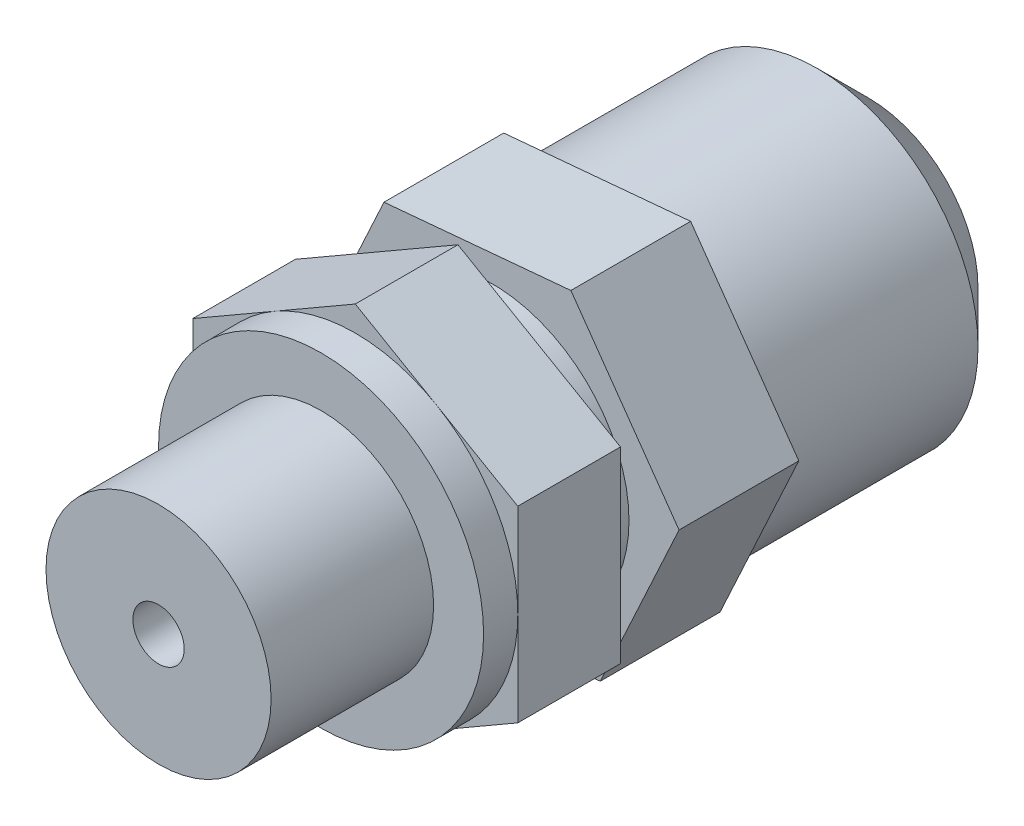
ISO-10303-21;
HEADER;
FILE_DESCRIPTION(('STEP AP214'),'2;1');
FILE_NAME('part.step','',(''),(''),'','','');
FILE_SCHEMA(('AUTOMOTIVE_DESIGN { 1 0 10303 214 1 1 1 1 }'));
ENDSEC;
DATA;
#1=APPLICATION_CONTEXT('core data for automotive mechanical design processes');
#2=APPLICATION_PROTOCOL_DEFINITION('international standard','automotive_design',2000,#1);
#3=PRODUCT_CONTEXT('',#1,'mechanical');
#4=PRODUCT('Part','Part','',(#3));
#5=PRODUCT_RELATED_PRODUCT_CATEGORY('part','',(#4));
#6=PRODUCT_DEFINITION_FORMATION('','',#4);
#7=PRODUCT_DEFINITION_CONTEXT('part definition',#1,'design');
#8=PRODUCT_DEFINITION('design','',#6,#7);
#9=PRODUCT_DEFINITION_SHAPE('','',#8);
#10=(LENGTH_UNIT() NAMED_UNIT(*) SI_UNIT(.MILLI.,.METRE.));
#11=(NAMED_UNIT(*) PLANE_ANGLE_UNIT() SI_UNIT($,.RADIAN.));
#12=(NAMED_UNIT(*) SI_UNIT($,.STERADIAN.) SOLID_ANGLE_UNIT());
#13=UNCERTAINTY_MEASURE_WITH_UNIT(LENGTH_MEASURE(1.E-05),#10,'distance_accuracy_value','');
#14=(GEOMETRIC_REPRESENTATION_CONTEXT(3) GLOBAL_UNCERTAINTY_ASSIGNED_CONTEXT((#13)) GLOBAL_UNIT_ASSIGNED_CONTEXT((#10,
#11,#12)) REPRESENTATION_CONTEXT('',''));
#15=CARTESIAN_POINT('',(0.,0.,0.));
#16=DIRECTION('',(0.,0.,1.));
#17=DIRECTION('',(1.,0.,0.));
#18=AXIS2_PLACEMENT_3D('',#15,#16,#17);
#19=CARTESIAN_POINT('',(-4.60221291555949,-9.95755841625801,-9.));
#20=DIRECTION('',(0.,0.,1.));
#21=DIRECTION('',(1.,0.,0.));
#22=AXIS2_PLACEMENT_3D('',#19,#20,#21);
#23=PLANE('',#22);
#24=DIRECTION('',(-0.576352859257245,0.817200943236117,0.));
#25=VECTOR('',#24,1.);
#26=CARTESIAN_POINT('',(-4.60221291555949,-9.95755841625801,-9.));
#27=LINE('',#26,#25);
#28=CARTESIAN_POINT('',(-4.60221291555949,-9.95755841625801,-9.));
#29=VERTEX_POINT('',#28);
#30=CARTESIAN_POINT('',(-10.9246050059267,-0.993145909629638,-9.));
#31=VERTEX_POINT('',#30);
#32=EDGE_CURVE('E162',#29,#31,#27,.T.);
#33=ORIENTED_EDGE('',*,*,#32,.T.);
#34=DIRECTION('',(0.41954034721046,0.907736689278629,0.));
#35=VECTOR('',#34,1.);
#36=CARTESIAN_POINT('',(-10.9246050059267,-0.993145909629638,-9.));
#37=LINE('',#36,#35);
#38=CARTESIAN_POINT('',(-6.32239209036723,8.96441250662837,-9.));
#39=VERTEX_POINT('',#38);
#40=EDGE_CURVE('E151',#31,#39,#37,.T.);
#41=ORIENTED_EDGE('',*,*,#40,.T.);
#42=DIRECTION('',(0.995893206467704,0.0905357460425129,0.));
#43=VECTOR('',#42,1.);
#44=CARTESIAN_POINT('',(-6.32239209036723,8.96441250662837,-9.));
#45=LINE('',#44,#43);
#46=CARTESIAN_POINT('',(4.60221291555949,9.95755841625801,-9.));
#47=VERTEX_POINT('',#46);
#48=EDGE_CURVE('E161',#39,#47,#45,.T.);
#49=ORIENTED_EDGE('',*,*,#48,.T.);
#50=DIRECTION('',(0.576352859257245,-0.817200943236117,0.));
#51=VECTOR('',#50,1.);
#52=CARTESIAN_POINT('',(4.60221291555949,9.95755841625801,-9.));
#53=LINE('',#52,#51);
#54=CARTESIAN_POINT('',(10.9246050059267,0.993145909629641,-9.));
#55=VERTEX_POINT('',#54);
#56=EDGE_CURVE('E676',#47,#55,#53,.T.);
#57=ORIENTED_EDGE('',*,*,#56,.T.);
#58=DIRECTION('',(-0.419540347210459,-0.907736689278629,0.));
#59=VECTOR('',#58,1.);
#60=CARTESIAN_POINT('',(10.9246050059267,0.993145909629641,-9.));
#61=LINE('',#60,#59);
#62=CARTESIAN_POINT('',(6.32239209036723,-8.96441250662837,-9.));
#63=VERTEX_POINT('',#62);
#64=EDGE_CURVE('E693',#55,#63,#61,.T.);
#65=ORIENTED_EDGE('',*,*,#64,.T.);
#66=DIRECTION('',(-0.995893206467704,-0.090535746042513,0.));
#67=VECTOR('',#66,1.);
#68=CARTESIAN_POINT('',(6.32239209036723,-8.96441250662837,-9.));
#69=LINE('',#68,#67);
#70=EDGE_CURVE('E167',#63,#29,#69,.T.);
#71=ORIENTED_EDGE('',*,*,#70,.T.);
#72=EDGE_LOOP('',(#33,#41,#49,#57,#65,#71));
#73=FACE_BOUND('',#72,.T.);
#74=CARTESIAN_POINT('',(0.,0.,-9.));
#75=DIRECTION('',(0.,0.,1.));
#76=DIRECTION('',(1.,0.,0.));
#77=AXIS2_PLACEMENT_3D('',#74,#75,#76);
#78=CIRCLE('',#77,9.4);
#79=CARTESIAN_POINT('',(9.4,0.,-9.));
#80=VERTEX_POINT('',#79);
#81=EDGE_CURVE('E259',#80,#80,#78,.F.);
#82=ORIENTED_EDGE('',*,*,#81,.F.);
#83=EDGE_LOOP('',(#82));
#84=FACE_BOUND('',#83,.T.);
#85=ADVANCED_FACE('F43',(#73,#84),#23,.F.);
#86=CARTESIAN_POINT('',(9.5,5.48482755730145,0.));
#87=DIRECTION('',(0.,0.,-1.));
#88=DIRECTION('',(-1.,0.,0.));
#89=AXIS2_PLACEMENT_3D('',#86,#87,#88);
#90=PLANE('',#89);
#91=DIRECTION('',(-0.866025403784439,0.5,0.));
#92=VECTOR('',#91,1.);
#93=CARTESIAN_POINT('',(9.5,5.48482755730145,0.));
#94=LINE('',#93,#92);
#95=CARTESIAN_POINT('',(9.5,5.48482755730145,0.));
#96=VERTEX_POINT('',#95);
#97=CARTESIAN_POINT('',(0.,10.9696551146029,0.));
#98=VERTEX_POINT('',#97);
#99=EDGE_CURVE('E203',#96,#98,#94,.T.);
#100=ORIENTED_EDGE('',*,*,#99,.F.);
#101=DIRECTION('',(0.,1.,0.));
#102=VECTOR('',#101,1.);
#103=CARTESIAN_POINT('',(9.5,-5.48482755730144,0.));
#104=LINE('',#103,#102);
#105=CARTESIAN_POINT('',(9.5,-5.48482755730144,0.));
#106=VERTEX_POINT('',#105);
#107=EDGE_CURVE('E240',#106,#96,#104,.T.);
#108=ORIENTED_EDGE('',*,*,#107,.F.);
#109=DIRECTION('',(0.866025403784439,0.5,0.));
#110=VECTOR('',#109,1.);
#111=CARTESIAN_POINT('',(0.,-10.9696551146029,0.));
#112=LINE('',#111,#110);
#113=CARTESIAN_POINT('',(0.,-10.9696551146029,0.));
#114=VERTEX_POINT('',#113);
#115=EDGE_CURVE('E238',#114,#106,#112,.T.);
#116=ORIENTED_EDGE('',*,*,#115,.F.);
#117=DIRECTION('',(0.866025403784439,-0.5,0.));
#118=VECTOR('',#117,1.);
#119=CARTESIAN_POINT('',(-9.5,-5.48482755730144,0.));
#120=LINE('',#119,#118);
#121=CARTESIAN_POINT('',(-9.5,-5.48482755730144,0.));
#122=VERTEX_POINT('',#121);
#123=EDGE_CURVE('E236',#122,#114,#120,.T.);
#124=ORIENTED_EDGE('',*,*,#123,.F.);
#125=DIRECTION('',(0.,-1.,0.));
#126=VECTOR('',#125,1.);
#127=CARTESIAN_POINT('',(-9.5,5.48482755730144,0.));
#128=LINE('',#127,#126);
#129=CARTESIAN_POINT('',(-9.5,5.48482755730144,0.));
#130=VERTEX_POINT('',#129);
#131=EDGE_CURVE('E234',#130,#122,#128,.T.);
#132=ORIENTED_EDGE('',*,*,#131,.F.);
#133=DIRECTION('',(-0.866025403784439,-0.5,0.));
#134=VECTOR('',#133,1.);
#135=CARTESIAN_POINT('',(0.,10.9696551146029,0.));
#136=LINE('',#135,#134);
#137=EDGE_CURVE('E232',#98,#130,#136,.T.);
#138=ORIENTED_EDGE('',*,*,#137,.F.);
#139=EDGE_LOOP('',(#100,#108,#116,#124,#132,#138));
#140=FACE_BOUND('',#139,.T.);
#141=CARTESIAN_POINT('',(0.,0.,0.));
#142=DIRECTION('',(0.,0.,-1.));
#143=DIRECTION('',(-1.,0.,0.));
#144=AXIS2_PLACEMENT_3D('',#141,#142,#143);
#145=CIRCLE('',#144,8.);
#146=CARTESIAN_POINT('',(-8.,0.,0.));
#147=VERTEX_POINT('',#146);
#148=EDGE_CURVE('E176',#147,#147,#145,.T.);
#149=ORIENTED_EDGE('',*,*,#148,.F.);
#150=EDGE_LOOP('',(#149));
#151=FACE_BOUND('',#150,.T.);
#152=ADVANCED_FACE('F275',(#140,#151),#90,.T.);
#153=CARTESIAN_POINT('',(0.,0.,8.));
#154=DIRECTION('',(0.,0.,1.));
#155=DIRECTION('',(1.,0.,0.));
#156=AXIS2_PLACEMENT_3D('',#153,#154,#155);
#157=PLANE('',#156);
#158=CARTESIAN_POINT('',(0.,0.,8.));
#159=DIRECTION('',(0.,0.,1.));
#160=DIRECTION('',(1.,0.,0.));
#161=AXIS2_PLACEMENT_3D('',#158,#159,#160);
#162=CIRCLE('',#161,9.5);
#163=CARTESIAN_POINT('',(9.5,0.,8.));
#164=VERTEX_POINT('',#163);
#165=EDGE_CURVE('E200',#164,#164,#162,.T.);
#166=ORIENTED_EDGE('',*,*,#165,.T.);
#167=EDGE_LOOP('',(#166));
#168=FACE_BOUND('',#167,.T.);
#169=CARTESIAN_POINT('',(0.,0.,8.));
#170=DIRECTION('',(0.,0.,1.));
#171=DIRECTION('',(1.,0.,0.));
#172=AXIS2_PLACEMENT_3D('',#169,#170,#171);
#173=CIRCLE('',#172,6.5785);
#174=CARTESIAN_POINT('',(6.5785,0.,8.));
#175=VERTEX_POINT('',#174);
#176=EDGE_CURVE('E191',#175,#175,#173,.T.);
#177=ORIENTED_EDGE('',*,*,#176,.F.);
#178=EDGE_LOOP('',(#177));
#179=FACE_BOUND('',#178,.T.);
#180=ADVANCED_FACE('F280',(#168,#179),#157,.T.);
#181=CARTESIAN_POINT('',(9.5,5.48482755730145,6.));
#182=DIRECTION('',(0.,0.,-1.));
#183=DIRECTION('',(-1.,0.,0.));
#184=AXIS2_PLACEMENT_3D('',#181,#182,#183);
#185=PLANE('',#184);
#186=CARTESIAN_POINT('',(0.,0.,6.));
#187=DIRECTION('',(0.,0.,1.));
#188=DIRECTION('',(1.,0.,0.));
#189=AXIS2_PLACEMENT_3D('',#186,#187,#188);
#190=CIRCLE('',#189,9.5);
#191=CARTESIAN_POINT('',(9.5,0.,6.));
#192=VERTEX_POINT('',#191);
#193=CARTESIAN_POINT('',(4.75,8.22724133595217,6.));
#194=VERTEX_POINT('',#193);
#195=EDGE_CURVE('E197',#192,#194,#190,.T.);
#196=ORIENTED_EDGE('',*,*,#195,.F.);
#197=DIRECTION('',(0.,1.,0.));
#198=VECTOR('',#197,1.);
#199=CARTESIAN_POINT('',(9.5,-5.48482755730144,6.));
#200=LINE('',#199,#198);
#201=CARTESIAN_POINT('',(9.5,5.48482755730145,6.));
#202=VERTEX_POINT('',#201);
#203=EDGE_CURVE('E226',#192,#202,#200,.T.);
#204=ORIENTED_EDGE('',*,*,#203,.T.);
#205=DIRECTION('',(-0.866025403784439,0.5,0.));
#206=VECTOR('',#205,1.);
#207=CARTESIAN_POINT('',(9.5,5.48482755730145,6.));
#208=LINE('',#207,#206);
#209=EDGE_CURVE('E207',#202,#194,#208,.T.);
#210=ORIENTED_EDGE('',*,*,#209,.T.);
#211=EDGE_LOOP('',(#196,#204,#210));
#212=FACE_BOUND('',#211,.T.);
#213=ADVANCED_FACE('F332',(#212),#185,.F.);
#214=CARTESIAN_POINT('',(-4.75,8.22724133595217,6.));
#215=VERTEX_POINT('',#214);
#216=EDGE_CURVE('E206',#194,#215,#190,.T.);
#217=ORIENTED_EDGE('',*,*,#216,.F.);
#218=CARTESIAN_POINT('',(0.,10.9696551146029,6.));
#219=VERTEX_POINT('',#218);
#220=EDGE_CURVE('E211',#194,#219,#208,.T.);
#221=ORIENTED_EDGE('',*,*,#220,.T.);
#222=DIRECTION('',(-0.866025403784439,-0.5,0.));
#223=VECTOR('',#222,1.);
#224=CARTESIAN_POINT('',(0.,10.9696551146029,6.));
#225=LINE('',#224,#223);
#226=EDGE_CURVE('E212',#219,#215,#225,.T.);
#227=ORIENTED_EDGE('',*,*,#226,.T.);
#228=EDGE_LOOP('',(#217,#221,#227));
#229=FACE_BOUND('',#228,.T.);
#230=ADVANCED_FACE('F339',(#229),#185,.F.);
#231=CARTESIAN_POINT('',(-9.5,0.,6.));
#232=VERTEX_POINT('',#231);
#233=EDGE_CURVE('E386',#215,#232,#190,.T.);
#234=ORIENTED_EDGE('',*,*,#233,.F.);
#235=CARTESIAN_POINT('',(-9.5,5.48482755730144,6.));
#236=VERTEX_POINT('',#235);
#237=EDGE_CURVE('E210',#215,#236,#225,.T.);
#238=ORIENTED_EDGE('',*,*,#237,.T.);
#239=DIRECTION('',(0.,-1.,0.));
#240=VECTOR('',#239,1.);
#241=CARTESIAN_POINT('',(-9.5,5.48482755730144,6.));
#242=LINE('',#241,#240);
#243=EDGE_CURVE('E216',#236,#232,#242,.T.);
#244=ORIENTED_EDGE('',*,*,#243,.T.);
#245=EDGE_LOOP('',(#234,#238,#244));
#246=FACE_BOUND('',#245,.T.);
#247=ADVANCED_FACE('F396',(#246),#185,.F.);
#248=CARTESIAN_POINT('',(-4.75,-8.22724133595217,6.));
#249=VERTEX_POINT('',#248);
#250=EDGE_CURVE('E388',#232,#249,#190,.T.);
#251=ORIENTED_EDGE('',*,*,#250,.F.);
#252=CARTESIAN_POINT('',(-9.5,-5.48482755730144,6.));
#253=VERTEX_POINT('',#252);
#254=EDGE_CURVE('E215',#232,#253,#242,.T.);
#255=ORIENTED_EDGE('',*,*,#254,.T.);
#256=DIRECTION('',(0.866025403784439,-0.5,0.));
#257=VECTOR('',#256,1.);
#258=CARTESIAN_POINT('',(-9.5,-5.48482755730144,6.));
#259=LINE('',#258,#257);
#260=EDGE_CURVE('E220',#253,#249,#259,.T.);
#261=ORIENTED_EDGE('',*,*,#260,.T.);
#262=EDGE_LOOP('',(#251,#255,#261));
#263=FACE_BOUND('',#262,.T.);
#264=ADVANCED_FACE('F391',(#263),#185,.F.);
#265=CARTESIAN_POINT('',(4.75,-8.22724133595216,6.));
#266=VERTEX_POINT('',#265);
#267=EDGE_CURVE('E66',#249,#266,#190,.T.);
#268=ORIENTED_EDGE('',*,*,#267,.F.);
#269=CARTESIAN_POINT('',(0.,-10.9696551146029,6.));
#270=VERTEX_POINT('',#269);
#271=EDGE_CURVE('E219',#249,#270,#259,.T.);
#272=ORIENTED_EDGE('',*,*,#271,.T.);
#273=DIRECTION('',(0.866025403784439,0.5,0.));
#274=VECTOR('',#273,1.);
#275=CARTESIAN_POINT('',(0.,-10.9696551146029,6.));
#276=LINE('',#275,#274);
#277=EDGE_CURVE('E224',#270,#266,#276,.T.);
#278=ORIENTED_EDGE('',*,*,#277,.T.);
#279=EDGE_LOOP('',(#268,#272,#278));
#280=FACE_BOUND('',#279,.T.);
#281=ADVANCED_FACE('F367',(#280),#185,.F.);
#282=EDGE_CURVE('E58',#266,#192,#190,.T.);
#283=ORIENTED_EDGE('',*,*,#282,.F.);
#284=CARTESIAN_POINT('',(9.5,-5.48482755730144,6.));
#285=VERTEX_POINT('',#284);
#286=EDGE_CURVE('E223',#266,#285,#276,.T.);
#287=ORIENTED_EDGE('',*,*,#286,.T.);
#288=EDGE_CURVE('E227',#285,#192,#200,.T.);
#289=ORIENTED_EDGE('',*,*,#288,.T.);
#290=EDGE_LOOP('',(#283,#287,#289));
#291=FACE_BOUND('',#290,.T.);
#292=ADVANCED_FACE('F341',(#291),#185,.F.);
#293=CARTESIAN_POINT('',(9.5,5.48482755730145,6.));
#294=DIRECTION('',(-0.5,-0.866025403784439,0.));
#295=DIRECTION('',(0.866025403784439,-0.5,0.));
#296=AXIS2_PLACEMENT_3D('',#293,#294,#295);
#297=PLANE('',#296);
#298=ORIENTED_EDGE('',*,*,#99,.T.);
#299=DIRECTION('',(0.,0.,-1.));
#300=VECTOR('',#299,1.);
#301=CARTESIAN_POINT('',(0.,10.9696551146029,6.));
#302=LINE('',#301,#300);
#303=EDGE_CURVE('E256',#219,#98,#302,.T.);
#304=ORIENTED_EDGE('',*,*,#303,.F.);
#305=ORIENTED_EDGE('',*,*,#220,.F.);
#306=ORIENTED_EDGE('',*,*,#209,.F.);
#307=DIRECTION('',(0.,0.,-1.));
#308=VECTOR('',#307,1.);
#309=CARTESIAN_POINT('',(9.5,5.48482755730145,6.));
#310=LINE('',#309,#308);
#311=EDGE_CURVE('E229',#202,#96,#310,.T.);
#312=ORIENTED_EDGE('',*,*,#311,.T.);
#313=EDGE_LOOP('',(#298,#304,#305,#306,#312));
#314=FACE_BOUND('',#313,.T.);
#315=ADVANCED_FACE('F360',(#314),#297,.F.);
#316=CARTESIAN_POINT('',(0.,10.9696551146029,6.));
#317=DIRECTION('',(0.5,-0.866025403784438,0.));
#318=DIRECTION('',(0.866025403784439,0.5,0.));
#319=AXIS2_PLACEMENT_3D('',#316,#317,#318);
#320=PLANE('',#319);
#321=ORIENTED_EDGE('',*,*,#137,.T.);
#322=DIRECTION('',(0.,0.,-1.));
#323=VECTOR('',#322,1.);
#324=CARTESIAN_POINT('',(-9.5,5.48482755730144,6.));
#325=LINE('',#324,#323);
#326=EDGE_CURVE('E253',#236,#130,#325,.T.);
#327=ORIENTED_EDGE('',*,*,#326,.F.);
#328=ORIENTED_EDGE('',*,*,#237,.F.);
#329=ORIENTED_EDGE('',*,*,#226,.F.);
#330=ORIENTED_EDGE('',*,*,#303,.T.);
#331=EDGE_LOOP('',(#321,#327,#328,#329,#330));
#332=FACE_BOUND('',#331,.T.);
#333=ADVANCED_FACE('F357',(#332),#320,.F.);
#334=CARTESIAN_POINT('',(-9.5,5.48482755730144,6.));
#335=DIRECTION('',(1.,0.,0.));
#336=DIRECTION('',(0.,1.,0.));
#337=AXIS2_PLACEMENT_3D('',#334,#335,#336);
#338=PLANE('',#337);
#339=ORIENTED_EDGE('',*,*,#131,.T.);
#340=DIRECTION('',(0.,0.,-1.));
#341=VECTOR('',#340,1.);
#342=CARTESIAN_POINT('',(-9.5,-5.48482755730144,6.));
#343=LINE('',#342,#341);
#344=EDGE_CURVE('E250',#253,#122,#343,.T.);
#345=ORIENTED_EDGE('',*,*,#344,.F.);
#346=ORIENTED_EDGE('',*,*,#254,.F.);
#347=ORIENTED_EDGE('',*,*,#243,.F.);
#348=ORIENTED_EDGE('',*,*,#326,.T.);
#349=EDGE_LOOP('',(#339,#345,#346,#347,#348));
#350=FACE_BOUND('',#349,.T.);
#351=ADVANCED_FACE('F353',(#350),#338,.F.);
#352=CARTESIAN_POINT('',(-9.5,-5.48482755730144,6.));
#353=DIRECTION('',(0.5,0.866025403784439,0.));
#354=DIRECTION('',(-0.866025403784439,0.5,0.));
#355=AXIS2_PLACEMENT_3D('',#352,#353,#354);
#356=PLANE('',#355);
#357=ORIENTED_EDGE('',*,*,#123,.T.);
#358=DIRECTION('',(0.,0.,-1.));
#359=VECTOR('',#358,1.);
#360=CARTESIAN_POINT('',(0.,-10.9696551146029,6.));
#361=LINE('',#360,#359);
#362=EDGE_CURVE('E247',#270,#114,#361,.T.);
#363=ORIENTED_EDGE('',*,*,#362,.F.);
#364=ORIENTED_EDGE('',*,*,#271,.F.);
#365=ORIENTED_EDGE('',*,*,#260,.F.);
#366=ORIENTED_EDGE('',*,*,#344,.T.);
#367=EDGE_LOOP('',(#357,#363,#364,#365,#366));
#368=FACE_BOUND('',#367,.T.);
#369=ADVANCED_FACE('F349',(#368),#356,.F.);
#370=CARTESIAN_POINT('',(0.,-10.9696551146029,6.));
#371=DIRECTION('',(-0.5,0.866025403784438,0.));
#372=DIRECTION('',(-0.866025403784439,-0.5,0.));
#373=AXIS2_PLACEMENT_3D('',#370,#371,#372);
#374=PLANE('',#373);
#375=ORIENTED_EDGE('',*,*,#115,.T.);
#376=DIRECTION('',(0.,0.,-1.));
#377=VECTOR('',#376,1.);
#378=CARTESIAN_POINT('',(9.5,-5.48482755730144,6.));
#379=LINE('',#378,#377);
#380=EDGE_CURVE('E244',#285,#106,#379,.T.);
#381=ORIENTED_EDGE('',*,*,#380,.F.);
#382=ORIENTED_EDGE('',*,*,#286,.F.);
#383=ORIENTED_EDGE('',*,*,#277,.F.);
#384=ORIENTED_EDGE('',*,*,#362,.T.);
#385=EDGE_LOOP('',(#375,#381,#382,#383,#384));
#386=FACE_BOUND('',#385,.T.);
#387=ADVANCED_FACE('F345',(#386),#374,.F.);
#388=CARTESIAN_POINT('',(9.5,-5.48482755730144,6.));
#389=DIRECTION('',(-1.,0.,0.));
#390=DIRECTION('',(0.,0.,1.));
#391=AXIS2_PLACEMENT_3D('',#388,#389,#390);
#392=PLANE('',#391);
#393=ORIENTED_EDGE('',*,*,#107,.T.);
#394=ORIENTED_EDGE('',*,*,#311,.F.);
#395=ORIENTED_EDGE('',*,*,#203,.F.);
#396=ORIENTED_EDGE('',*,*,#288,.F.);
#397=ORIENTED_EDGE('',*,*,#380,.T.);
#398=EDGE_LOOP('',(#393,#394,#395,#396,#397));
#399=FACE_BOUND('',#398,.T.);
#400=ADVANCED_FACE('F336',(#399),#392,.F.);
#401=CARTESIAN_POINT('',(0.,0.,8.));
#402=DIRECTION('',(0.,0.,-1.));
#403=DIRECTION('',(-1.,0.,0.));
#404=AXIS2_PLACEMENT_3D('',#401,#402,#403);
#405=CYLINDRICAL_SURFACE('',#404,9.5);
#406=ORIENTED_EDGE('',*,*,#165,.F.);
#407=EDGE_LOOP('',(#406));
#408=FACE_BOUND('',#407,.T.);
#409=ORIENTED_EDGE('',*,*,#195,.T.);
#410=ORIENTED_EDGE('',*,*,#216,.T.);
#411=ORIENTED_EDGE('',*,*,#233,.T.);
#412=ORIENTED_EDGE('',*,*,#250,.T.);
#413=ORIENTED_EDGE('',*,*,#267,.T.);
#414=ORIENTED_EDGE('',*,*,#282,.T.);
#415=EDGE_LOOP('',(#409,#410,#411,#412,#413,#414));
#416=FACE_BOUND('',#415,.T.);
#417=ADVANCED_FACE('F328',(#408,#416),#405,.T.);
#418=CARTESIAN_POINT('',(0.,0.,17.5));
#419=DIRECTION('',(0.,0.,-1.));
#420=DIRECTION('',(-1.,0.,0.));
#421=AXIS2_PLACEMENT_3D('',#418,#419,#420);
#422=CYLINDRICAL_SURFACE('',#421,6.5785);
#423=CARTESIAN_POINT('',(0.,0.,17.5));
#424=DIRECTION('',(0.,0.,1.));
#425=DIRECTION('',(1.,0.,0.));
#426=AXIS2_PLACEMENT_3D('',#423,#424,#425);
#427=CIRCLE('',#426,6.5785);
#428=CARTESIAN_POINT('',(6.5785,0.,17.5));
#429=VERTEX_POINT('',#428);
#430=EDGE_CURVE('E194',#429,#429,#427,.T.);
#431=ORIENTED_EDGE('',*,*,#430,.F.);
#432=EDGE_LOOP('',(#431));
#433=FACE_BOUND('',#432,.T.);
#434=ORIENTED_EDGE('',*,*,#176,.T.);
#435=EDGE_LOOP('',(#434));
#436=FACE_BOUND('',#435,.T.);
#437=ADVANCED_FACE('F324',(#433,#436),#422,.T.);
#438=CARTESIAN_POINT('',(0.,0.,17.5));
#439=DIRECTION('',(0.,0.,1.));
#440=DIRECTION('',(1.,0.,0.));
#441=AXIS2_PLACEMENT_3D('',#438,#439,#440);
#442=PLANE('',#441);
#443=CARTESIAN_POINT('',(0.,0.,17.5));
#444=DIRECTION('',(0.,0.,1.));
#445=DIRECTION('',(1.,0.,0.));
#446=AXIS2_PLACEMENT_3D('',#443,#444,#445);
#447=CIRCLE('',#446,1.5);
#448=CARTESIAN_POINT('',(1.5,0.,17.5));
#449=VERTEX_POINT('',#448);
#450=EDGE_CURVE('E186',#449,#449,#447,.T.);
#451=ORIENTED_EDGE('',*,*,#450,.F.);
#452=EDGE_LOOP('',(#451));
#453=FACE_BOUND('',#452,.T.);
#454=ORIENTED_EDGE('',*,*,#430,.T.);
#455=EDGE_LOOP('',(#454));
#456=FACE_BOUND('',#455,.T.);
#457=ADVANCED_FACE('F320',(#453,#456),#442,.T.);
#458=CARTESIAN_POINT('',(0.,0.,8.));
#459=DIRECTION('',(0.,0.,1.));
#460=DIRECTION('',(1.,0.,0.));
#461=AXIS2_PLACEMENT_3D('',#458,#459,#460);
#462=CYLINDRICAL_SURFACE('',#461,1.5);
#463=CARTESIAN_POINT('',(0.,0.,8.));
#464=DIRECTION('',(0.,0.,1.));
#465=DIRECTION('',(1.,0.,0.));
#466=AXIS2_PLACEMENT_3D('',#463,#464,#465);
#467=CIRCLE('',#466,1.5);
#468=CARTESIAN_POINT('',(1.5,0.,8.));
#469=VERTEX_POINT('',#468);
#470=EDGE_CURVE('E188',#469,#469,#467,.T.);
#471=ORIENTED_EDGE('',*,*,#470,.F.);
#472=EDGE_LOOP('',(#471));
#473=FACE_BOUND('',#472,.T.);
#474=ORIENTED_EDGE('',*,*,#450,.T.);
#475=EDGE_LOOP('',(#474));
#476=FACE_BOUND('',#475,.T.);
#477=ADVANCED_FACE('F316',(#473,#476),#462,.F.);
#478=CARTESIAN_POINT('',(0.,0.,8.));
#479=DIRECTION('',(0.,0.,1.));
#480=DIRECTION('',(1.,0.,0.));
#481=AXIS2_PLACEMENT_3D('',#478,#479,#480);
#482=PLANE('',#481);
#483=ORIENTED_EDGE('',*,*,#470,.T.);
#484=EDGE_LOOP('',(#483));
#485=FACE_BOUND('',#484,.T.);
#486=ADVANCED_FACE('F312',(#485),#482,.T.);
#487=CARTESIAN_POINT('',(0.,0.,-2.));
#488=DIRECTION('',(0.,0.,1.));
#489=DIRECTION('',(1.,0.,0.));
#490=AXIS2_PLACEMENT_3D('',#487,#488,#489);
#491=CYLINDRICAL_SURFACE('',#490,8.);
#492=CARTESIAN_POINT('',(0.,0.,-2.));
#493=DIRECTION('',(0.,0.,-1.));
#494=DIRECTION('',(-1.,0.,0.));
#495=AXIS2_PLACEMENT_3D('',#492,#493,#494);
#496=CIRCLE('',#495,8.);
#497=CARTESIAN_POINT('',(-8.,0.,-2.));
#498=VERTEX_POINT('',#497);
#499=EDGE_CURVE('E179',#498,#498,#496,.T.);
#500=ORIENTED_EDGE('',*,*,#499,.F.);
#501=EDGE_LOOP('',(#500));
#502=FACE_BOUND('',#501,.T.);
#503=ORIENTED_EDGE('',*,*,#148,.T.);
#504=EDGE_LOOP('',(#503));
#505=FACE_BOUND('',#504,.T.);
#506=ADVANCED_FACE('F288',(#502,#505),#491,.T.);
#507=CARTESIAN_POINT('',(-4.60221291555949,-9.95755841625801,-2.));
#508=DIRECTION('',(0.,0.,1.));
#509=DIRECTION('',(1.,0.,0.));
#510=AXIS2_PLACEMENT_3D('',#507,#508,#509);
#511=PLANE('',#510);
#512=DIRECTION('',(-0.576352859257245,0.817200943236117,0.));
#513=VECTOR('',#512,1.);
#514=CARTESIAN_POINT('',(-4.60221291555949,-9.95755841625801,-2.));
#515=LINE('',#514,#513);
#516=CARTESIAN_POINT('',(-4.60221291555949,-9.95755841625801,-2.));
#517=VERTEX_POINT('',#516);
#518=CARTESIAN_POINT('',(-10.9246050059267,-0.993145909629638,-2.));
#519=VERTEX_POINT('',#518);
#520=EDGE_CURVE('E175',#517,#519,#515,.T.);
#521=ORIENTED_EDGE('',*,*,#520,.F.);
#522=DIRECTION('',(-0.995893206467704,-0.090535746042513,0.));
#523=VECTOR('',#522,1.);
#524=CARTESIAN_POINT('',(6.32239209036723,-8.96441250662837,-2.));
#525=LINE('',#524,#523);
#526=CARTESIAN_POINT('',(6.32239209036723,-8.96441250662837,-2.));
#527=VERTEX_POINT('',#526);
#528=EDGE_CURVE('E171',#527,#517,#525,.T.);
#529=ORIENTED_EDGE('',*,*,#528,.F.);
#530=DIRECTION('',(-0.419540347210459,-0.907736689278629,0.));
#531=VECTOR('',#530,1.);
#532=CARTESIAN_POINT('',(10.9246050059267,0.993145909629641,-2.));
#533=LINE('',#532,#531);
#534=CARTESIAN_POINT('',(10.9246050059267,0.993145909629641,-2.));
#535=VERTEX_POINT('',#534);
#536=EDGE_CURVE('E680',#535,#527,#533,.T.);
#537=ORIENTED_EDGE('',*,*,#536,.F.);
#538=DIRECTION('',(0.576352859257245,-0.817200943236117,0.));
#539=VECTOR('',#538,1.);
#540=CARTESIAN_POINT('',(4.60221291555949,9.95755841625801,-2.));
#541=LINE('',#540,#539);
#542=CARTESIAN_POINT('',(4.60221291555949,9.95755841625801,-2.));
#543=VERTEX_POINT('',#542);
#544=EDGE_CURVE('E671',#543,#535,#541,.T.);
#545=ORIENTED_EDGE('',*,*,#544,.F.);
#546=DIRECTION('',(0.995893206467704,0.0905357460425129,0.));
#547=VECTOR('',#546,1.);
#548=CARTESIAN_POINT('',(-6.32239209036723,8.96441250662837,-2.));
#549=LINE('',#548,#547);
#550=CARTESIAN_POINT('',(-6.32239209036723,8.96441250662837,-2.));
#551=VERTEX_POINT('',#550);
#552=EDGE_CURVE('E667',#551,#543,#549,.T.);
#553=ORIENTED_EDGE('',*,*,#552,.F.);
#554=DIRECTION('',(0.41954034721046,0.907736689278629,0.));
#555=VECTOR('',#554,1.);
#556=CARTESIAN_POINT('',(-10.9246050059267,-0.993145909629638,-2.));
#557=LINE('',#556,#555);
#558=EDGE_CURVE('E672',#519,#551,#557,.T.);
#559=ORIENTED_EDGE('',*,*,#558,.F.);
#560=EDGE_LOOP('',(#521,#529,#537,#545,#553,#559));
#561=FACE_BOUND('',#560,.T.);
#562=ORIENTED_EDGE('',*,*,#499,.T.);
#563=EDGE_LOOP('',(#562));
#564=FACE_BOUND('',#563,.T.);
#565=ADVANCED_FACE('F285',(#561,#564),#511,.T.);
#566=CARTESIAN_POINT('',(-4.60221291555949,-9.95755841625801,-9.));
#567=DIRECTION('',(0.817200943236117,0.576352859257245,0.));
#568=DIRECTION('',(-0.576352859257245,0.817200943236117,0.));
#569=AXIS2_PLACEMENT_3D('',#566,#567,#568);
#570=PLANE('',#569);
#571=ORIENTED_EDGE('',*,*,#520,.T.);
#572=DIRECTION('',(0.,0.,1.));
#573=VECTOR('',#572,1.);
#574=CARTESIAN_POINT('',(-10.9246050059267,-0.993145909629638,-9.));
#575=LINE('',#574,#573);
#576=EDGE_CURVE('E155',#31,#519,#575,.T.);
#577=ORIENTED_EDGE('',*,*,#576,.F.);
#578=ORIENTED_EDGE('',*,*,#32,.F.);
#579=DIRECTION('',(0.,0.,1.));
#580=VECTOR('',#579,1.);
#581=CARTESIAN_POINT('',(-4.60221291555949,-9.95755841625801,-9.));
#582=LINE('',#581,#580);
#583=EDGE_CURVE('E686',#29,#517,#582,.T.);
#584=ORIENTED_EDGE('',*,*,#583,.T.);
#585=EDGE_LOOP('',(#571,#577,#578,#584));
#586=FACE_BOUND('',#585,.T.);
#587=ADVANCED_FACE('F173',(#586),#570,.F.);
#588=CARTESIAN_POINT('',(-10.9246050059267,-0.993145909629638,-9.));
#589=DIRECTION('',(0.907736689278629,-0.41954034721046,0.));
#590=DIRECTION('',(0.41954034721046,0.907736689278629,0.));
#591=AXIS2_PLACEMENT_3D('',#588,#589,#590);
#592=PLANE('',#591);
#593=ORIENTED_EDGE('',*,*,#558,.T.);
#594=DIRECTION('',(0.,0.,1.));
#595=VECTOR('',#594,1.);
#596=CARTESIAN_POINT('',(-6.32239209036723,8.96441250662837,-9.));
#597=LINE('',#596,#595);
#598=EDGE_CURVE('E158',#39,#551,#597,.T.);
#599=ORIENTED_EDGE('',*,*,#598,.F.);
#600=ORIENTED_EDGE('',*,*,#40,.F.);
#601=ORIENTED_EDGE('',*,*,#576,.T.);
#602=EDGE_LOOP('',(#593,#599,#600,#601));
#603=FACE_BOUND('',#602,.T.);
#604=ADVANCED_FACE('F153',(#603),#592,.F.);
#605=CARTESIAN_POINT('',(-6.32239209036723,8.96441250662837,-9.));
#606=DIRECTION('',(0.0905357460425129,-0.995893206467704,0.));
#607=DIRECTION('',(0.995893206467705,0.0905357460425129,0.));
#608=AXIS2_PLACEMENT_3D('',#605,#606,#607);
#609=PLANE('',#608);
#610=ORIENTED_EDGE('',*,*,#552,.T.);
#611=DIRECTION('',(0.,0.,1.));
#612=VECTOR('',#611,1.);
#613=CARTESIAN_POINT('',(4.60221291555949,9.95755841625801,-9.));
#614=LINE('',#613,#612);
#615=EDGE_CURVE('E181',#47,#543,#614,.T.);
#616=ORIENTED_EDGE('',*,*,#615,.F.);
#617=ORIENTED_EDGE('',*,*,#48,.F.);
#618=ORIENTED_EDGE('',*,*,#598,.T.);
#619=EDGE_LOOP('',(#610,#616,#617,#618));
#620=FACE_BOUND('',#619,.T.);
#621=ADVANCED_FACE('F301',(#620),#609,.F.);
#622=CARTESIAN_POINT('',(4.60221291555949,9.95755841625801,-9.));
#623=DIRECTION('',(-0.817200943236117,-0.576352859257245,0.));
#624=DIRECTION('',(0.576352859257245,-0.817200943236117,0.));
#625=AXIS2_PLACEMENT_3D('',#622,#623,#624);
#626=PLANE('',#625);
#627=ORIENTED_EDGE('',*,*,#544,.T.);
#628=DIRECTION('',(0.,0.,1.));
#629=VECTOR('',#628,1.);
#630=CARTESIAN_POINT('',(10.9246050059267,0.993145909629641,-9.));
#631=LINE('',#630,#629);
#632=EDGE_CURVE('E677',#55,#535,#631,.T.);
#633=ORIENTED_EDGE('',*,*,#632,.F.);
#634=ORIENTED_EDGE('',*,*,#56,.F.);
#635=ORIENTED_EDGE('',*,*,#615,.T.);
#636=EDGE_LOOP('',(#627,#633,#634,#635));
#637=FACE_BOUND('',#636,.T.);
#638=ADVANCED_FACE('F297',(#637),#626,.F.);
#639=CARTESIAN_POINT('',(10.9246050059267,0.993145909629641,-9.));
#640=DIRECTION('',(-0.907736689278629,0.419540347210459,0.));
#641=DIRECTION('',(-0.419540347210459,-0.907736689278629,0.));
#642=AXIS2_PLACEMENT_3D('',#639,#640,#641);
#643=PLANE('',#642);
#644=ORIENTED_EDGE('',*,*,#536,.T.);
#645=DIRECTION('',(0.,0.,1.));
#646=VECTOR('',#645,1.);
#647=CARTESIAN_POINT('',(6.32239209036723,-8.96441250662837,-9.));
#648=LINE('',#647,#646);
#649=EDGE_CURVE('E688',#63,#527,#648,.T.);
#650=ORIENTED_EDGE('',*,*,#649,.F.);
#651=ORIENTED_EDGE('',*,*,#64,.F.);
#652=ORIENTED_EDGE('',*,*,#632,.T.);
#653=EDGE_LOOP('',(#644,#650,#651,#652));
#654=FACE_BOUND('',#653,.T.);
#655=ADVANCED_FACE('F293',(#654),#643,.F.);
#656=CARTESIAN_POINT('',(6.32239209036723,-8.96441250662837,-9.));
#657=DIRECTION('',(-0.090535746042513,0.995893206467704,0.));
#658=DIRECTION('',(-0.995893206467705,-0.090535746042513,0.));
#659=AXIS2_PLACEMENT_3D('',#656,#657,#658);
#660=PLANE('',#659);
#661=ORIENTED_EDGE('',*,*,#528,.T.);
#662=ORIENTED_EDGE('',*,*,#583,.F.);
#663=ORIENTED_EDGE('',*,*,#70,.F.);
#664=ORIENTED_EDGE('',*,*,#649,.T.);
#665=EDGE_LOOP('',(#661,#662,#663,#664));
#666=FACE_BOUND('',#665,.T.);
#667=ADVANCED_FACE('F290',(#666),#660,.F.);
#668=CARTESIAN_POINT('',(0.,0.,-24.));
#669=DIRECTION('',(0.,0.,1.));
#670=DIRECTION('',(1.,0.,0.));
#671=AXIS2_PLACEMENT_3D('',#668,#669,#670);
#672=CYLINDRICAL_SURFACE('',#671,9.4);
#673=CARTESIAN_POINT('',(0.,0.,-21.));
#674=DIRECTION('',(0.,0.,-1.));
#675=DIRECTION('',(-1.,0.,0.));
#676=AXIS2_PLACEMENT_3D('',#673,#674,#675);
#677=CIRCLE('',#676,9.4);
#678=CARTESIAN_POINT('',(-9.4,0.,-21.));
#679=VERTEX_POINT('',#678);
#680=EDGE_CURVE('E11',#679,#679,#677,.F.);
#681=ORIENTED_EDGE('',*,*,#680,.T.);
#682=EDGE_LOOP('',(#681));
#683=FACE_BOUND('',#682,.T.);
#684=ORIENTED_EDGE('',*,*,#81,.T.);
#685=EDGE_LOOP('',(#684));
#686=FACE_BOUND('',#685,.T.);
#687=ADVANCED_FACE('F271',(#683,#686),#672,.T.);
#688=CARTESIAN_POINT('',(0.,0.,-24.));
#689=DIRECTION('',(0.,0.,-1.));
#690=DIRECTION('',(-1.,0.,0.));
#691=AXIS2_PLACEMENT_3D('',#688,#689,#690);
#692=PLANE('',#691);
#693=CARTESIAN_POINT('',(0.,0.,-24.));
#694=DIRECTION('',(0.,0.,-1.));
#695=DIRECTION('',(-1.,0.,0.));
#696=AXIS2_PLACEMENT_3D('',#693,#694,#695);
#697=CIRCLE('',#696,6.4);
#698=CARTESIAN_POINT('',(-6.4,0.,-24.));
#699=VERTEX_POINT('',#698);
#700=EDGE_CURVE('E51',#699,#699,#697,.T.);
#701=ORIENTED_EDGE('',*,*,#700,.T.);
#702=EDGE_LOOP('',(#701));
#703=FACE_BOUND('',#702,.T.);
#704=ADVANCED_FACE('F264',(#703),#692,.T.);
#705=CARTESIAN_POINT('',(0.,0.,-24.));
#706=DIRECTION('',(0.,0.,1.));
#707=DIRECTION('',(1.,0.,0.));
#708=AXIS2_PLACEMENT_3D('',#705,#706,#707);
#709=CONICAL_SURFACE('',#708,6.4,0.785398163397447);
#710=ORIENTED_EDGE('',*,*,#680,.F.);
#711=EDGE_LOOP('',(#710));
#712=FACE_BOUND('',#711,.T.);
#713=ORIENTED_EDGE('',*,*,#700,.F.);
#714=EDGE_LOOP('',(#713));
#715=FACE_BOUND('',#714,.T.);
#716=ADVANCED_FACE('F45',(#712,#715),#709,.T.);
#717=CLOSED_SHELL('',(#85,#152,#180,#213,#230,#247,#264,#281,#292,#315,#333,#351,#369,#387,#400,
#417,#437,#457,#477,#486,#506,#565,#587,#604,#621,#638,#655,#667,#687,#704,#716));
#718=MANIFOLD_SOLID_BREP('B2',#717);
#719=ADVANCED_BREP_SHAPE_REPRESENTATION('',(#18,#718),#14);
#720=SHAPE_DEFINITION_REPRESENTATION(#9,#719);
ENDSEC;
END-ISO-10303-21;
